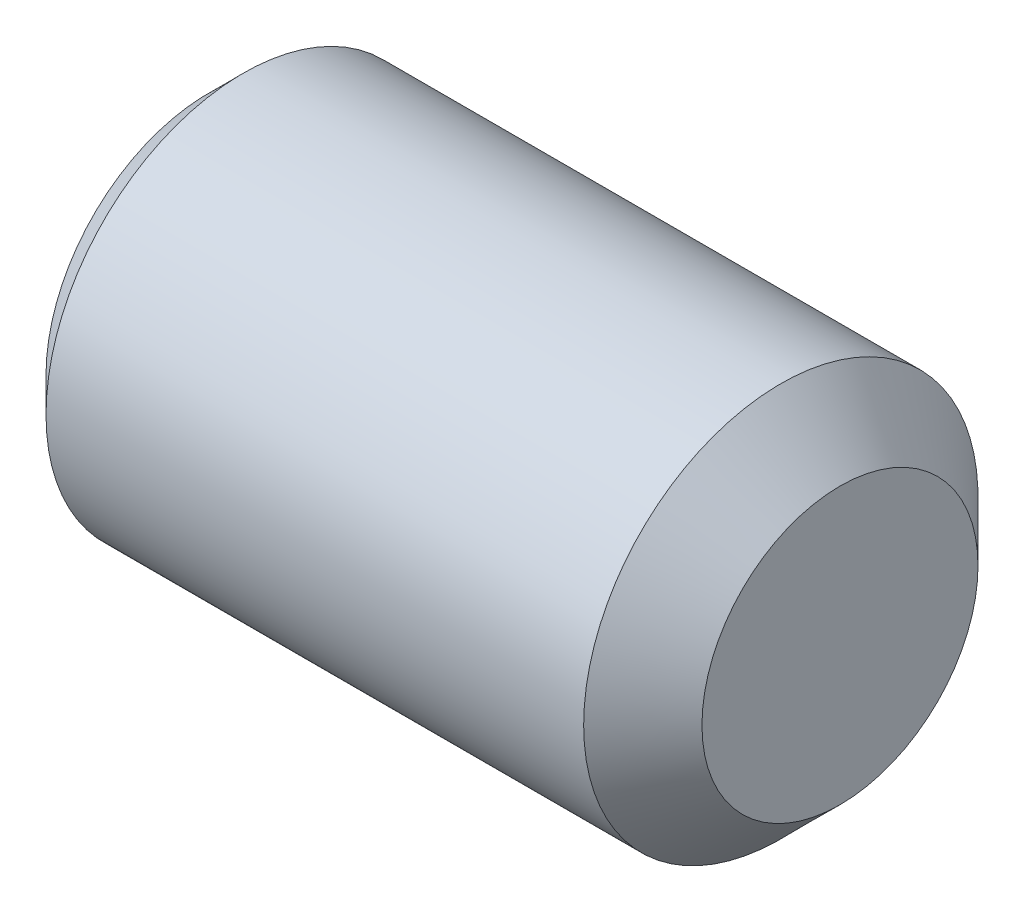
ISO-10303-21;
HEADER;
FILE_DESCRIPTION(('STEP AP214'),'2;1');
FILE_NAME('part.step','',(''),(''),'','','');
FILE_SCHEMA(('AUTOMOTIVE_DESIGN { 1 0 10303 214 1 1 1 1 }'));
ENDSEC;
DATA;
#1=APPLICATION_CONTEXT('core data for automotive mechanical design processes');
#2=APPLICATION_PROTOCOL_DEFINITION('international standard','automotive_design',2000,#1);
#3=PRODUCT_CONTEXT('',#1,'mechanical');
#4=PRODUCT('Part','Part','',(#3));
#5=PRODUCT_RELATED_PRODUCT_CATEGORY('part','',(#4));
#6=PRODUCT_DEFINITION_FORMATION('','',#4);
#7=PRODUCT_DEFINITION_CONTEXT('part definition',#1,'design');
#8=PRODUCT_DEFINITION('design','',#6,#7);
#9=PRODUCT_DEFINITION_SHAPE('','',#8);
#10=(LENGTH_UNIT() NAMED_UNIT(*) SI_UNIT(.MILLI.,.METRE.));
#11=(NAMED_UNIT(*) PLANE_ANGLE_UNIT() SI_UNIT($,.RADIAN.));
#12=(NAMED_UNIT(*) SI_UNIT($,.STERADIAN.) SOLID_ANGLE_UNIT());
#13=UNCERTAINTY_MEASURE_WITH_UNIT(LENGTH_MEASURE(1.E-05),#10,'distance_accuracy_value','');
#14=(GEOMETRIC_REPRESENTATION_CONTEXT(3) GLOBAL_UNCERTAINTY_ASSIGNED_CONTEXT((#13)) GLOBAL_UNIT_ASSIGNED_CONTEXT((#10,
#11,#12)) REPRESENTATION_CONTEXT('',''));
#15=CARTESIAN_POINT('',(0.,0.,0.));
#16=DIRECTION('',(0.,0.,1.));
#17=DIRECTION('',(1.,0.,0.));
#18=AXIS2_PLACEMENT_3D('',#15,#16,#17);
#19=CARTESIAN_POINT('',(2.00000000011369,1.25,2.1650635094611));
#20=DIRECTION('',(-1.,0.,0.));
#21=DIRECTION('',(0.,0.,1.));
#22=AXIS2_PLACEMENT_3D('',#19,#20,#21);
#23=PLANE('',#22);
#24=CARTESIAN_POINT('',(2.00000000011369,0.,0.));
#25=DIRECTION('',(-1.,0.,0.));
#26=DIRECTION('',(0.,0.,1.));
#27=AXIS2_PLACEMENT_3D('',#24,#25,#26);
#28=CIRCLE('',#27,1.25);
#29=CARTESIAN_POINT('',(2.00000000011369,0.625,1.08253175473055));
#30=VERTEX_POINT('',#29);
#31=CARTESIAN_POINT('',(2.00000000011369,1.25,0.));
#32=VERTEX_POINT('',#31);
#33=EDGE_CURVE('E48',#30,#32,#28,.T.);
#34=ORIENTED_EDGE('',*,*,#33,.F.);
#35=DIRECTION('',(0.,0.866025403784439,-0.5));
#36=VECTOR('',#35,1.);
#37=CARTESIAN_POINT('',(2.00000000011369,0.,1.44337567297406));
#38=LINE('',#37,#36);
#39=CARTESIAN_POINT('',(2.00000000011369,1.25,0.721687836487033));
#40=VERTEX_POINT('',#39);
#41=EDGE_CURVE('E237',#30,#40,#38,.T.);
#42=ORIENTED_EDGE('',*,*,#41,.T.);
#43=DIRECTION('',(0.,0.,-1.));
#44=VECTOR('',#43,1.);
#45=CARTESIAN_POINT('',(2.00000000011369,1.25,0.721687836487033));
#46=LINE('',#45,#44);
#47=EDGE_CURVE('E230',#40,#32,#46,.T.);
#48=ORIENTED_EDGE('',*,*,#47,.T.);
#49=EDGE_LOOP('',(#34,#42,#48));
#50=FACE_BOUND('',#49,.T.);
#51=ADVANCED_FACE('F37',(#50),#23,.T.);
#52=CARTESIAN_POINT('',(2.00000000011369,0.625,-1.08253175473055));
#53=VERTEX_POINT('',#52);
#54=EDGE_CURVE('E11',#32,#53,#28,.T.);
#55=ORIENTED_EDGE('',*,*,#54,.F.);
#56=CARTESIAN_POINT('',(2.00000000011369,1.25,-0.721687836487032));
#57=VERTEX_POINT('',#56);
#58=EDGE_CURVE('E233',#32,#57,#46,.T.);
#59=ORIENTED_EDGE('',*,*,#58,.T.);
#60=DIRECTION('',(0.,-0.866025403784439,-0.5));
#61=VECTOR('',#60,1.);
#62=CARTESIAN_POINT('',(2.00000000011369,1.25,-0.721687836487032));
#63=LINE('',#62,#61);
#64=EDGE_CURVE('E226',#57,#53,#63,.T.);
#65=ORIENTED_EDGE('',*,*,#64,.T.);
#66=EDGE_LOOP('',(#55,#59,#65));
#67=FACE_BOUND('',#66,.T.);
#68=ADVANCED_FACE('F124',(#67),#23,.T.);
#69=CARTESIAN_POINT('',(2.00000000011369,-0.624999999999999,-1.08253175473055));
#70=VERTEX_POINT('',#69);
#71=EDGE_CURVE('E46',#53,#70,#28,.T.);
#72=ORIENTED_EDGE('',*,*,#71,.F.);
#73=CARTESIAN_POINT('',(2.00000000011369,0.,-1.44337567297406));
#74=VERTEX_POINT('',#73);
#75=EDGE_CURVE('E229',#53,#74,#63,.T.);
#76=ORIENTED_EDGE('',*,*,#75,.T.);
#77=DIRECTION('',(0.,-0.866025403784439,0.5));
#78=VECTOR('',#77,1.);
#79=CARTESIAN_POINT('',(2.00000000011369,0.,-1.44337567297406));
#80=LINE('',#79,#78);
#81=EDGE_CURVE('E222',#74,#70,#80,.T.);
#82=ORIENTED_EDGE('',*,*,#81,.T.);
#83=EDGE_LOOP('',(#72,#76,#82));
#84=FACE_BOUND('',#83,.T.);
#85=ADVANCED_FACE('F129',(#84),#23,.T.);
#86=CARTESIAN_POINT('',(2.00000000011369,-1.25,0.));
#87=VERTEX_POINT('',#86);
#88=EDGE_CURVE('E260',#70,#87,#28,.T.);
#89=ORIENTED_EDGE('',*,*,#88,.F.);
#90=CARTESIAN_POINT('',(2.00000000011369,-1.25,-0.721687836487033));
#91=VERTEX_POINT('',#90);
#92=EDGE_CURVE('E225',#70,#91,#80,.T.);
#93=ORIENTED_EDGE('',*,*,#92,.T.);
#94=DIRECTION('',(0.,0.,1.));
#95=VECTOR('',#94,1.);
#96=CARTESIAN_POINT('',(2.00000000011369,-1.25,-0.721687836487033));
#97=LINE('',#96,#95);
#98=EDGE_CURVE('E193',#91,#87,#97,.T.);
#99=ORIENTED_EDGE('',*,*,#98,.T.);
#100=EDGE_LOOP('',(#89,#93,#99));
#101=FACE_BOUND('',#100,.T.);
#102=ADVANCED_FACE('F268',(#101),#23,.T.);
#103=CARTESIAN_POINT('',(2.00000000011369,-0.625,1.08253175473055));
#104=VERTEX_POINT('',#103);
#105=EDGE_CURVE('E55',#87,#104,#28,.T.);
#106=ORIENTED_EDGE('',*,*,#105,.F.);
#107=CARTESIAN_POINT('',(2.00000000011369,-1.25,0.721687836487033));
#108=VERTEX_POINT('',#107);
#109=EDGE_CURVE('E221',#87,#108,#97,.T.);
#110=ORIENTED_EDGE('',*,*,#109,.T.);
#111=DIRECTION('',(0.,0.866025403784439,0.5));
#112=VECTOR('',#111,1.);
#113=CARTESIAN_POINT('',(2.00000000011369,-1.25,0.721687836487033));
#114=LINE('',#113,#112);
#115=EDGE_CURVE('E238',#108,#104,#114,.T.);
#116=ORIENTED_EDGE('',*,*,#115,.T.);
#117=EDGE_LOOP('',(#106,#110,#116));
#118=FACE_BOUND('',#117,.T.);
#119=ADVANCED_FACE('F122',(#118),#23,.T.);
#120=CARTESIAN_POINT('',(0.,2.067,0.));
#121=DIRECTION('',(1.,0.,0.));
#122=DIRECTION('',(0.,0.,-1.));
#123=AXIS2_PLACEMENT_3D('',#120,#121,#122);
#124=PLANE('',#123);
#125=DIRECTION('',(0.,0.866025403784439,-0.5));
#126=VECTOR('',#125,1.);
#127=CARTESIAN_POINT('',(1.13686837721616E-10,0.,1.44337567297406));
#128=LINE('',#127,#126);
#129=CARTESIAN_POINT('',(0.,0.,1.44337567297406));
#130=VERTEX_POINT('',#129);
#131=CARTESIAN_POINT('',(1.13686837721616E-10,1.25,0.721687836487033));
#132=VERTEX_POINT('',#131);
#133=EDGE_CURVE('E215',#130,#132,#128,.T.);
#134=ORIENTED_EDGE('',*,*,#133,.F.);
#135=DIRECTION('',(0.,0.866025403784439,0.5));
#136=VECTOR('',#135,1.);
#137=CARTESIAN_POINT('',(1.13686837721616E-10,-1.25,0.721687836487033));
#138=LINE('',#137,#136);
#139=CARTESIAN_POINT('',(1.13686837721616E-10,-1.25,0.721687836487033));
#140=VERTEX_POINT('',#139);
#141=EDGE_CURVE('E63',#140,#130,#138,.T.);
#142=ORIENTED_EDGE('',*,*,#141,.F.);
#143=DIRECTION('',(0.,0.,1.));
#144=VECTOR('',#143,1.);
#145=CARTESIAN_POINT('',(1.13686837721616E-10,-1.25,-0.721687836487033));
#146=LINE('',#145,#144);
#147=CARTESIAN_POINT('',(1.13686837721616E-10,-1.25,-0.721687836487033));
#148=VERTEX_POINT('',#147);
#149=EDGE_CURVE('E202',#148,#140,#146,.T.);
#150=ORIENTED_EDGE('',*,*,#149,.F.);
#151=DIRECTION('',(0.,-0.866025403784439,0.5));
#152=VECTOR('',#151,1.);
#153=CARTESIAN_POINT('',(1.13686837721616E-10,0.,-1.44337567297406));
#154=LINE('',#153,#152);
#155=CARTESIAN_POINT('',(1.13686837721616E-10,0.,-1.44337567297406));
#156=VERTEX_POINT('',#155);
#157=EDGE_CURVE('E206',#156,#148,#154,.T.);
#158=ORIENTED_EDGE('',*,*,#157,.F.);
#159=DIRECTION('',(0.,-0.866025403784439,-0.5));
#160=VECTOR('',#159,1.);
#161=CARTESIAN_POINT('',(1.13686837721616E-10,1.25,-0.721687836487032));
#162=LINE('',#161,#160);
#163=CARTESIAN_POINT('',(1.13686837721616E-10,1.25,-0.721687836487032));
#164=VERTEX_POINT('',#163);
#165=EDGE_CURVE('E209',#164,#156,#162,.T.);
#166=ORIENTED_EDGE('',*,*,#165,.F.);
#167=DIRECTION('',(0.,0.,-1.));
#168=VECTOR('',#167,1.);
#169=CARTESIAN_POINT('',(1.13686837721616E-10,1.25,0.721687836487033));
#170=LINE('',#169,#168);
#171=EDGE_CURVE('E212',#132,#164,#170,.T.);
#172=ORIENTED_EDGE('',*,*,#171,.F.);
#173=EDGE_LOOP('',(#134,#142,#150,#158,#166,#172));
#174=FACE_BOUND('',#173,.T.);
#175=CARTESIAN_POINT('',(0.,0.,0.));
#176=DIRECTION('',(-1.,0.,0.));
#177=DIRECTION('',(0.,0.,1.));
#178=AXIS2_PLACEMENT_3D('',#175,#176,#177);
#179=CIRCLE('',#178,2.067);
#180=CARTESIAN_POINT('',(0.,0.,2.067));
#181=VERTEX_POINT('',#180);
#182=EDGE_CURVE('E183',#181,#181,#179,.T.);
#183=ORIENTED_EDGE('',*,*,#182,.T.);
#184=EDGE_LOOP('',(#183));
#185=FACE_BOUND('',#184,.T.);
#186=ADVANCED_FACE('F39',(#174,#185),#124,.F.);
#187=CARTESIAN_POINT('',(8.,0.,0.));
#188=DIRECTION('',(-1.,0.,0.));
#189=DIRECTION('',(0.,0.,1.));
#190=AXIS2_PLACEMENT_3D('',#187,#188,#189);
#191=PLANE('',#190);
#192=CARTESIAN_POINT('',(8.,0.,0.));
#193=DIRECTION('',(-1.,0.,0.));
#194=DIRECTION('',(0.,0.,1.));
#195=AXIS2_PLACEMENT_3D('',#192,#193,#194);
#196=CIRCLE('',#195,1.75);
#197=CARTESIAN_POINT('',(8.,0.,1.75));
#198=VERTEX_POINT('',#197);
#199=EDGE_CURVE('E41',#198,#198,#196,.T.);
#200=ORIENTED_EDGE('',*,*,#199,.F.);
#201=EDGE_LOOP('',(#200));
#202=FACE_BOUND('',#201,.T.);
#203=ADVANCED_FACE('F165',(#202),#191,.F.);
#204=CARTESIAN_POINT('',(8.,0.,0.));
#205=DIRECTION('',(-1.,0.,0.));
#206=DIRECTION('',(0.,0.,1.));
#207=AXIS2_PLACEMENT_3D('',#204,#205,#206);
#208=CONICAL_SURFACE('',#207,1.75,0.785398163397443);
#209=CARTESIAN_POINT('',(7.24999999999999,0.,0.));
#210=DIRECTION('',(-1.,0.,0.));
#211=DIRECTION('',(0.,0.,1.));
#212=AXIS2_PLACEMENT_3D('',#209,#210,#211);
#213=CIRCLE('',#212,2.5);
#214=CARTESIAN_POINT('',(7.24999999999999,0.,2.5));
#215=VERTEX_POINT('',#214);
#216=EDGE_CURVE('E177',#215,#215,#213,.T.);
#217=ORIENTED_EDGE('',*,*,#216,.F.);
#218=EDGE_LOOP('',(#217));
#219=FACE_BOUND('',#218,.T.);
#220=ORIENTED_EDGE('',*,*,#199,.T.);
#221=EDGE_LOOP('',(#220));
#222=FACE_BOUND('',#221,.T.);
#223=ADVANCED_FACE('F162',(#219,#222),#208,.T.);
#224=CARTESIAN_POINT('',(-10.7450145430878,0.,0.));
#225=DIRECTION('',(-1.,0.,0.));
#226=DIRECTION('',(0.,0.,1.));
#227=AXIS2_PLACEMENT_3D('',#224,#225,#226);
#228=CYLINDRICAL_SURFACE('',#227,2.5);
#229=CARTESIAN_POINT('',(0.433000000000003,0.,0.));
#230=DIRECTION('',(-1.,0.,0.));
#231=DIRECTION('',(0.,0.,1.));
#232=AXIS2_PLACEMENT_3D('',#229,#230,#231);
#233=CIRCLE('',#232,2.5);
#234=CARTESIAN_POINT('',(0.433000000000003,0.,2.5));
#235=VERTEX_POINT('',#234);
#236=EDGE_CURVE('E179',#235,#235,#233,.T.);
#237=ORIENTED_EDGE('',*,*,#236,.F.);
#238=EDGE_LOOP('',(#237));
#239=FACE_BOUND('',#238,.T.);
#240=ORIENTED_EDGE('',*,*,#216,.T.);
#241=EDGE_LOOP('',(#240));
#242=FACE_BOUND('',#241,.T.);
#243=ADVANCED_FACE('F158',(#239,#242),#228,.T.);
#244=CARTESIAN_POINT('',(0.433000000000003,0.,0.));
#245=DIRECTION('',(1.,0.,0.));
#246=DIRECTION('',(0.,0.,-1.));
#247=AXIS2_PLACEMENT_3D('',#244,#245,#246);
#248=CONICAL_SURFACE('',#247,2.5,0.785398163397444);
#249=ORIENTED_EDGE('',*,*,#182,.F.);
#250=EDGE_LOOP('',(#249));
#251=FACE_BOUND('',#250,.T.);
#252=ORIENTED_EDGE('',*,*,#236,.T.);
#253=EDGE_LOOP('',(#252));
#254=FACE_BOUND('',#253,.T.);
#255=ADVANCED_FACE('F155',(#251,#254),#248,.T.);
#256=CARTESIAN_POINT('',(2.00000000011369,-1.25,0.721687836487033));
#257=DIRECTION('',(0.,-0.5,0.866025403784439));
#258=DIRECTION('',(0.,-0.866025403784439,-0.5));
#259=AXIS2_PLACEMENT_3D('',#256,#257,#258);
#260=PLANE('',#259);
#261=ORIENTED_EDGE('',*,*,#141,.T.);
#262=DIRECTION('',(-1.,0.,0.));
#263=VECTOR('',#262,1.);
#264=CARTESIAN_POINT('',(2.00000000011369,0.,1.44337567297406));
#265=LINE('',#264,#263);
#266=CARTESIAN_POINT('',(2.00000000011369,0.,1.44337567297406));
#267=VERTEX_POINT('',#266);
#268=EDGE_CURVE('E190',#267,#130,#265,.T.);
#269=ORIENTED_EDGE('',*,*,#268,.F.);
#270=EDGE_CURVE('E205',#104,#267,#114,.T.);
#271=ORIENTED_EDGE('',*,*,#270,.F.);
#272=ORIENTED_EDGE('',*,*,#115,.F.);
#273=DIRECTION('',(-1.,0.,0.));
#274=VECTOR('',#273,1.);
#275=CARTESIAN_POINT('',(2.00000000011369,-1.25,0.721687836487033));
#276=LINE('',#275,#274);
#277=EDGE_CURVE('E189',#108,#140,#276,.T.);
#278=ORIENTED_EDGE('',*,*,#277,.T.);
#279=EDGE_LOOP('',(#261,#269,#271,#272,#278));
#280=FACE_BOUND('',#279,.T.);
#281=ADVANCED_FACE('F137',(#280),#260,.F.);
#282=CARTESIAN_POINT('',(2.00000000011369,-1.25,-0.721687836487033));
#283=DIRECTION('',(0.,-1.,0.));
#284=DIRECTION('',(0.,0.,-1.));
#285=AXIS2_PLACEMENT_3D('',#282,#283,#284);
#286=PLANE('',#285);
#287=ORIENTED_EDGE('',*,*,#149,.T.);
#288=ORIENTED_EDGE('',*,*,#277,.F.);
#289=ORIENTED_EDGE('',*,*,#109,.F.);
#290=ORIENTED_EDGE('',*,*,#98,.F.);
#291=DIRECTION('',(-1.,0.,0.));
#292=VECTOR('',#291,1.);
#293=CARTESIAN_POINT('',(2.00000000011369,-1.25,-0.721687836487033));
#294=LINE('',#293,#292);
#295=EDGE_CURVE('E199',#91,#148,#294,.T.);
#296=ORIENTED_EDGE('',*,*,#295,.T.);
#297=EDGE_LOOP('',(#287,#288,#289,#290,#296));
#298=FACE_BOUND('',#297,.T.);
#299=ADVANCED_FACE('F133',(#298),#286,.F.);
#300=CARTESIAN_POINT('',(2.00000000011369,0.,-1.44337567297406));
#301=DIRECTION('',(0.,-0.5,-0.866025403784439));
#302=DIRECTION('',(0.,0.866025403784439,-0.5));
#303=AXIS2_PLACEMENT_3D('',#300,#301,#302);
#304=PLANE('',#303);
#305=ORIENTED_EDGE('',*,*,#157,.T.);
#306=ORIENTED_EDGE('',*,*,#295,.F.);
#307=ORIENTED_EDGE('',*,*,#92,.F.);
#308=ORIENTED_EDGE('',*,*,#81,.F.);
#309=DIRECTION('',(-1.,0.,0.));
#310=VECTOR('',#309,1.);
#311=CARTESIAN_POINT('',(2.00000000011369,0.,-1.44337567297406));
#312=LINE('',#311,#310);
#313=EDGE_CURVE('E197',#74,#156,#312,.T.);
#314=ORIENTED_EDGE('',*,*,#313,.T.);
#315=EDGE_LOOP('',(#305,#306,#307,#308,#314));
#316=FACE_BOUND('',#315,.T.);
#317=ADVANCED_FACE('F136',(#316),#304,.F.);
#318=CARTESIAN_POINT('',(2.00000000011369,1.25,-0.721687836487032));
#319=DIRECTION('',(0.,0.5,-0.866025403784439));
#320=DIRECTION('',(0.,0.866025403784439,0.5));
#321=AXIS2_PLACEMENT_3D('',#318,#319,#320);
#322=PLANE('',#321);
#323=ORIENTED_EDGE('',*,*,#165,.T.);
#324=ORIENTED_EDGE('',*,*,#313,.F.);
#325=ORIENTED_EDGE('',*,*,#75,.F.);
#326=ORIENTED_EDGE('',*,*,#64,.F.);
#327=DIRECTION('',(-1.,0.,0.));
#328=VECTOR('',#327,1.);
#329=CARTESIAN_POINT('',(2.00000000011369,1.25,-0.721687836487032));
#330=LINE('',#329,#328);
#331=EDGE_CURVE('E195',#57,#164,#330,.T.);
#332=ORIENTED_EDGE('',*,*,#331,.T.);
#333=EDGE_LOOP('',(#323,#324,#325,#326,#332));
#334=FACE_BOUND('',#333,.T.);
#335=ADVANCED_FACE('F141',(#334),#322,.F.);
#336=CARTESIAN_POINT('',(2.00000000011369,1.25,0.721687836487033));
#337=DIRECTION('',(0.,1.,0.));
#338=DIRECTION('',(0.,0.,1.));
#339=AXIS2_PLACEMENT_3D('',#336,#337,#338);
#340=PLANE('',#339);
#341=ORIENTED_EDGE('',*,*,#171,.T.);
#342=ORIENTED_EDGE('',*,*,#331,.F.);
#343=ORIENTED_EDGE('',*,*,#58,.F.);
#344=ORIENTED_EDGE('',*,*,#47,.F.);
#345=DIRECTION('',(-1.,0.,0.));
#346=VECTOR('',#345,1.);
#347=CARTESIAN_POINT('',(2.00000000011369,1.25,0.721687836487033));
#348=LINE('',#347,#346);
#349=EDGE_CURVE('E192',#40,#132,#348,.T.);
#350=ORIENTED_EDGE('',*,*,#349,.T.);
#351=EDGE_LOOP('',(#341,#342,#343,#344,#350));
#352=FACE_BOUND('',#351,.T.);
#353=ADVANCED_FACE('F145',(#352),#340,.F.);
#354=CARTESIAN_POINT('',(2.00000000011369,0.,1.44337567297406));
#355=DIRECTION('',(0.,0.5,0.866025403784439));
#356=DIRECTION('',(0.,-0.866025403784439,0.5));
#357=AXIS2_PLACEMENT_3D('',#354,#355,#356);
#358=PLANE('',#357);
#359=ORIENTED_EDGE('',*,*,#133,.T.);
#360=ORIENTED_EDGE('',*,*,#349,.F.);
#361=ORIENTED_EDGE('',*,*,#41,.F.);
#362=EDGE_CURVE('E234',#267,#30,#38,.T.);
#363=ORIENTED_EDGE('',*,*,#362,.F.);
#364=ORIENTED_EDGE('',*,*,#268,.T.);
#365=EDGE_LOOP('',(#359,#360,#361,#363,#364));
#366=FACE_BOUND('',#365,.T.);
#367=ADVANCED_FACE('F119',(#366),#358,.F.);
#368=EDGE_CURVE('E176',#104,#30,#28,.T.);
#369=ORIENTED_EDGE('',*,*,#368,.F.);
#370=ORIENTED_EDGE('',*,*,#270,.T.);
#371=ORIENTED_EDGE('',*,*,#362,.T.);
#372=EDGE_LOOP('',(#369,#370,#371));
#373=FACE_BOUND('',#372,.T.);
#374=ADVANCED_FACE('F114',(#373),#23,.T.);
#375=CARTESIAN_POINT('',(2.72168783660072,0.,0.));
#376=DIRECTION('',(-1.,0.,0.));
#377=DIRECTION('',(0.,0.,1.));
#378=AXIS2_PLACEMENT_3D('',#375,#376,#377);
#379=CONICAL_SURFACE('',#378,0.,1.0471975511966);
#380=ORIENTED_EDGE('',*,*,#33,.T.);
#381=ORIENTED_EDGE('',*,*,#54,.T.);
#382=ORIENTED_EDGE('',*,*,#71,.T.);
#383=ORIENTED_EDGE('',*,*,#88,.T.);
#384=ORIENTED_EDGE('',*,*,#105,.T.);
#385=ORIENTED_EDGE('',*,*,#368,.T.);
#386=EDGE_LOOP('',(#380,#381,#382,#383,#384,#385));
#387=FACE_BOUND('',#386,.T.);
#388=CARTESIAN_POINT('',(2.72168783660072,0.,0.));
#389=VERTEX_POINT('',#388);
#390=VERTEX_LOOP('',#389);
#391=FACE_BOUND('',#390,.T.);
#392=ADVANCED_FACE('F112',(#387,#391),#379,.F.);
#393=CLOSED_SHELL('',(#51,#68,#85,#102,#119,#186,#203,#223,#243,#255,#281,#299,#317,#335,#353,
#367,#374,#392));
#394=MANIFOLD_SOLID_BREP('B2',#393);
#395=ADVANCED_BREP_SHAPE_REPRESENTATION('',(#18,#394),#14);
#396=SHAPE_DEFINITION_REPRESENTATION(#9,#395);
ENDSEC;
END-ISO-10303-21;
